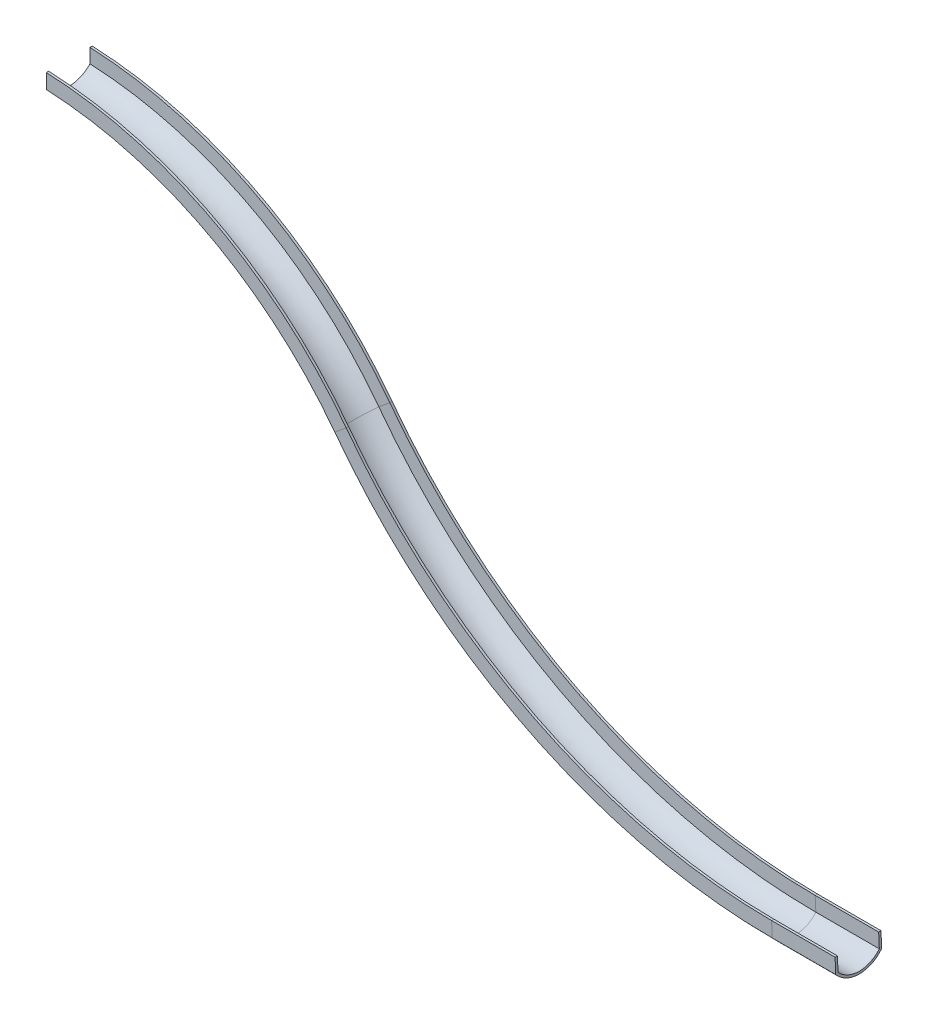
ISO-10303-21;
HEADER;
FILE_DESCRIPTION(('STEP AP214'),'2;1');
FILE_NAME('part.step','',(''),(''),'','','');
FILE_SCHEMA(('AUTOMOTIVE_DESIGN { 1 0 10303 214 1 1 1 1 }'));
ENDSEC;
DATA;
#1=APPLICATION_CONTEXT('core data for automotive mechanical design processes');
#2=APPLICATION_PROTOCOL_DEFINITION('international standard','automotive_design',2000,#1);
#3=PRODUCT_CONTEXT('',#1,'mechanical');
#4=PRODUCT('Part','Part','',(#3));
#5=PRODUCT_RELATED_PRODUCT_CATEGORY('part','',(#4));
#6=PRODUCT_DEFINITION_FORMATION('','',#4);
#7=PRODUCT_DEFINITION_CONTEXT('part definition',#1,'design');
#8=PRODUCT_DEFINITION('design','',#6,#7);
#9=PRODUCT_DEFINITION_SHAPE('','',#8);
#10=(LENGTH_UNIT() NAMED_UNIT(*) SI_UNIT(.MILLI.,.METRE.));
#11=(NAMED_UNIT(*) PLANE_ANGLE_UNIT() SI_UNIT($,.RADIAN.));
#12=(NAMED_UNIT(*) SI_UNIT($,.STERADIAN.) SOLID_ANGLE_UNIT());
#13=UNCERTAINTY_MEASURE_WITH_UNIT(LENGTH_MEASURE(1.E-05),#10,'distance_accuracy_value','');
#14=(GEOMETRIC_REPRESENTATION_CONTEXT(3) GLOBAL_UNCERTAINTY_ASSIGNED_CONTEXT((#13)) GLOBAL_UNIT_ASSIGNED_CONTEXT((#10,
#11,#12)) REPRESENTATION_CONTEXT('',''));
#15=CARTESIAN_POINT('',(0.,0.,0.));
#16=DIRECTION('',(0.,0.,1.));
#17=DIRECTION('',(1.,0.,0.));
#18=AXIS2_PLACEMENT_3D('',#15,#16,#17);
#19=CARTESIAN_POINT('',(0.,649.982066690495,-4.82835176366716));
#20=DIRECTION('',(1.,0.,0.));
#21=DIRECTION('',(0.,0.,-1.));
#22=AXIS2_PLACEMENT_3D('',#19,#20,#21);
#23=PLANE('',#22);
#24=CARTESIAN_POINT('',(0.,649.982066690495,-4.82835176366716));
#25=DIRECTION('',(-1.,0.,0.));
#26=DIRECTION('',(0.,0.,-1.));
#27=AXIS2_PLACEMENT_3D('',#24,#25,#26);
#28=CIRCLE('',#27,600.);
#29=CARTESIAN_POINT('',(0.,243.093628659328,-445.783903941613));
#30=VERTEX_POINT('',#29);
#31=CARTESIAN_POINT('',(0.,250.000205972115,442.401467340854));
#32=VERTEX_POINT('',#31);
#33=EDGE_CURVE('E223',#30,#32,#28,.T.);
#34=ORIENTED_EDGE('',*,*,#33,.F.);
#35=DIRECTION('',(0.,-1.,0.));
#36=VECTOR('',#35,1.);
#37=CARTESIAN_POINT('',(0.,243.093628659327,-445.783903941613));
#38=LINE('',#37,#36);
#39=CARTESIAN_POINT('',(0.,550.000205972116,-445.783903941613));
#40=VERTEX_POINT('',#39);
#41=EDGE_CURVE('E143',#40,#30,#38,.T.);
#42=ORIENTED_EDGE('',*,*,#41,.F.);
#43=DIRECTION('',(0.,0.,1.));
#44=VECTOR('',#43,1.);
#45=CARTESIAN_POINT('',(0.,550.000205972115,-445.783903941613));
#46=LINE('',#45,#44);
#47=CARTESIAN_POINT('',(0.,550.000205972116,-495.783903941613));
#48=VERTEX_POINT('',#47);
#49=EDGE_CURVE('E147',#48,#40,#46,.T.);
#50=ORIENTED_EDGE('',*,*,#49,.F.);
#51=DIRECTION('',(0.,1.,0.));
#52=VECTOR('',#51,1.);
#53=CARTESIAN_POINT('',(0.,223.99774093936,-495.783903941613));
#54=LINE('',#53,#52);
#55=CARTESIAN_POINT('',(0.,223.997740939361,-495.783903941613));
#56=VERTEX_POINT('',#55);
#57=EDGE_CURVE('E152',#56,#48,#54,.T.);
#58=ORIENTED_EDGE('',*,*,#57,.F.);
#59=CARTESIAN_POINT('',(0.,649.982066690495,-4.82835176366716));
#60=DIRECTION('',(1.,0.,0.));
#61=DIRECTION('',(0.,0.,-1.));
#62=AXIS2_PLACEMENT_3D('',#59,#60,#61);
#63=CIRCLE('',#62,650.);
#64=CARTESIAN_POINT('',(0.,231.338415128351,492.401467340854));
#65=VERTEX_POINT('',#64);
#66=EDGE_CURVE('E261',#65,#56,#63,.T.);
#67=ORIENTED_EDGE('',*,*,#66,.F.);
#68=DIRECTION('',(0.,-1.,0.));
#69=VECTOR('',#68,1.);
#70=CARTESIAN_POINT('',(0.,231.338415128351,492.401467340854));
#71=LINE('',#70,#69);
#72=CARTESIAN_POINT('',(0.,550.000205972116,492.401467340854));
#73=VERTEX_POINT('',#72);
#74=EDGE_CURVE('E207',#73,#65,#71,.T.);
#75=ORIENTED_EDGE('',*,*,#74,.F.);
#76=DIRECTION('',(0.,0.,1.));
#77=VECTOR('',#76,1.);
#78=CARTESIAN_POINT('',(0.,550.000205972115,492.401467340854));
#79=LINE('',#78,#77);
#80=CARTESIAN_POINT('',(0.,550.000205972116,442.401467340854));
#81=VERTEX_POINT('',#80);
#82=EDGE_CURVE('E202',#81,#73,#79,.T.);
#83=ORIENTED_EDGE('',*,*,#82,.F.);
#84=DIRECTION('',(0.,1.,0.));
#85=VECTOR('',#84,1.);
#86=CARTESIAN_POINT('',(0.,250.000205972115,442.401467340854));
#87=LINE('',#86,#85);
#88=EDGE_CURVE('E204',#32,#81,#87,.T.);
#89=ORIENTED_EDGE('',*,*,#88,.F.);
#90=EDGE_LOOP('',(#34,#42,#50,#58,#67,#75,#83,#89));
#91=FACE_BOUND('',#90,.T.);
#92=ADVANCED_FACE('F39',(#91),#23,.F.);
#93=CARTESIAN_POINT('',(16969.7298408799,-7350.72316806612,-4.82835176366716));
#94=DIRECTION('',(0.998914993516345,0.0465707604430124,0.));
#95=DIRECTION('',(0.,0.,-1.));
#96=AXIS2_PLACEMENT_3D('',#93,#94,#95);
#97=PLANE('',#96);
#98=CARTESIAN_POINT('',(16969.7298408799,-7350.72316806612,-4.82835176366716));
#99=DIRECTION('',(-0.998914993516345,-0.0465707604430124,0.));
#100=DIRECTION('',(0.,0.,-1.));
#101=AXIS2_PLACEMENT_3D('',#98,#99,#100);
#102=CIRCLE('',#101,600.);
#103=CARTESIAN_POINT('',(16988.6789448545,-7757.1701295039,-445.783903941613));
#104=VERTEX_POINT('',#103);
#105=CARTESIAN_POINT('',(16988.357300297,-7750.27104587228,442.401467340854));
#106=VERTEX_POINT('',#105);
#107=EDGE_CURVE('E53',#104,#106,#102,.T.);
#108=ORIENTED_EDGE('',*,*,#107,.T.);
#109=DIRECTION('',(-0.0465707604430124,0.998914993516345,0.));
#110=VECTOR('',#109,1.);
#111=CARTESIAN_POINT('',(16988.357300297,-7750.27104587228,442.401467340854));
#112=LINE('',#111,#110);
#113=CARTESIAN_POINT('',(16974.3860721641,-7450.59654781737,442.401467340854));
#114=VERTEX_POINT('',#113);
#115=EDGE_CURVE('E11',#106,#114,#112,.T.);
#116=ORIENTED_EDGE('',*,*,#115,.T.);
#117=DIRECTION('',(0.,0.,1.));
#118=VECTOR('',#117,1.);
#119=CARTESIAN_POINT('',(16974.3860721641,-7450.59654781737,492.401467340854));
#120=LINE('',#119,#118);
#121=CARTESIAN_POINT('',(16974.3860721641,-7450.59654781737,492.401467340854));
#122=VERTEX_POINT('',#121);
#123=EDGE_CURVE('E172',#114,#122,#120,.T.);
#124=ORIENTED_EDGE('',*,*,#123,.T.);
#125=DIRECTION('',(0.0465707604430124,-0.998914993516345,0.));
#126=VECTOR('',#125,1.);
#127=CARTESIAN_POINT('',(16989.2263940878,-7768.91258855198,492.401467340854));
#128=LINE('',#127,#126);
#129=CARTESIAN_POINT('',(16989.2263940878,-7768.91258855198,492.401467340854));
#130=VERTEX_POINT('',#129);
#131=EDGE_CURVE('E169',#122,#130,#128,.T.);
#132=ORIENTED_EDGE('',*,*,#131,.T.);
#133=CARTESIAN_POINT('',(16969.7298408799,-7350.72316806612,-4.82835176366716));
#134=DIRECTION('',(0.998914993516345,0.0465707604430124,0.));
#135=DIRECTION('',(0.,0.,-1.));
#136=AXIS2_PLACEMENT_3D('',#133,#134,#135);
#137=CIRCLE('',#136,650.);
#138=CARTESIAN_POINT('',(16989.5682548669,-7776.24529806188,-495.783903941613));
#139=VERTEX_POINT('',#138);
#140=EDGE_CURVE('E165',#130,#139,#137,.T.);
#141=ORIENTED_EDGE('',*,*,#140,.T.);
#142=DIRECTION('',(-0.0465707604430124,0.998914993516345,0.));
#143=VECTOR('',#142,1.);
#144=CARTESIAN_POINT('',(16989.5682548669,-7776.24529806188,-495.783903941613));
#145=LINE('',#144,#143);
#146=CARTESIAN_POINT('',(16974.3860721641,-7450.59654781737,-495.783903941613));
#147=VERTEX_POINT('',#146);
#148=EDGE_CURVE('E305',#139,#147,#145,.T.);
#149=ORIENTED_EDGE('',*,*,#148,.T.);
#150=DIRECTION('',(0.,0.,1.));
#151=VECTOR('',#150,1.);
#152=CARTESIAN_POINT('',(16974.3860721641,-7450.59654781737,-445.783903941613));
#153=LINE('',#152,#151);
#154=CARTESIAN_POINT('',(16974.3860721641,-7450.59654781737,-445.783903941613));
#155=VERTEX_POINT('',#154);
#156=EDGE_CURVE('E328',#147,#155,#153,.T.);
#157=ORIENTED_EDGE('',*,*,#156,.T.);
#158=DIRECTION('',(0.0465707604430124,-0.998914993516345,0.));
#159=VECTOR('',#158,1.);
#160=CARTESIAN_POINT('',(16988.6789448545,-7757.1701295039,-445.783903941613));
#161=LINE('',#160,#159);
#162=EDGE_CURVE('E59',#155,#104,#161,.T.);
#163=ORIENTED_EDGE('',*,*,#162,.T.);
#164=EDGE_LOOP('',(#108,#116,#124,#132,#141,#149,#157,#163));
#165=FACE_BOUND('',#164,.T.);
#166=ADVANCED_FACE('F432',(#165),#97,.T.);
#167=CARTESIAN_POINT('',(-372.5660835441,-7991.31994813076,0.));
#168=DIRECTION('',(0.,0.,-1.));
#169=DIRECTION('',(-1.,0.,0.));
#170=AXIS2_PLACEMENT_3D('',#167,#168,#169);
#171=CYLINDRICAL_SURFACE('',#170,8549.44182163323);
#172=CARTESIAN_POINT('',(-372.5660835441,-7991.31994813076,492.401467340854));
#173=DIRECTION('',(0.,0.,-1.));
#174=DIRECTION('',(0.0435778254670814,0.99905003534736,0.));
#175=AXIS2_PLACEMENT_3D('',#172,#173,#174);
#176=CIRCLE('',#175,8549.44182163323);
#177=CARTESIAN_POINT('',(6454.38071349598,-2844.88886514951,492.401467340854));
#178=VERTEX_POINT('',#177);
#179=EDGE_CURVE('E232',#73,#178,#176,.T.);
#180=ORIENTED_EDGE('',*,*,#179,.T.);
#181=DIRECTION('',(0.,0.,1.));
#182=VECTOR('',#181,1.);
#183=CARTESIAN_POINT('',(6454.38071349598,-2844.88886514951,492.401467340854));
#184=LINE('',#183,#182);
#185=CARTESIAN_POINT('',(6454.38071349598,-2844.88886514951,442.401467340854));
#186=VERTEX_POINT('',#185);
#187=EDGE_CURVE('E228',#186,#178,#184,.T.);
#188=ORIENTED_EDGE('',*,*,#187,.F.);
#189=CARTESIAN_POINT('',(-372.5660835441,-7991.31994813076,442.401467340854));
#190=DIRECTION('',(0.,0.,-1.));
#191=DIRECTION('',(0.0435778254670814,0.99905003534736,0.));
#192=AXIS2_PLACEMENT_3D('',#189,#190,#191);
#193=CIRCLE('',#192,8549.44182163323);
#194=EDGE_CURVE('E219',#81,#186,#193,.T.);
#195=ORIENTED_EDGE('',*,*,#194,.F.);
#196=ORIENTED_EDGE('',*,*,#82,.T.);
#197=EDGE_LOOP('',(#180,#188,#195,#196));
#198=FACE_BOUND('',#197,.T.);
#199=ADVANCED_FACE('F226',(#198),#171,.T.);
#200=CARTESIAN_POINT('',(0.,231.338415128351,492.401467340854));
#201=DIRECTION('',(0.,0.,1.));
#202=DIRECTION('',(1.,0.,0.));
#203=AXIS2_PLACEMENT_3D('',#200,#201,#202);
#204=PLANE('',#203);
#205=CARTESIAN_POINT('',(-372.5660835441,-7991.31994813076,492.401467340854));
#206=DIRECTION('',(0.,0.,-1.));
#207=DIRECTION('',(0.0452632496511293,0.998975093899252,0.));
#208=AXIS2_PLACEMENT_3D('',#205,#206,#207);
#209=CIRCLE('',#208,8231.09446218924);
#210=CARTESIAN_POINT('',(6208.52207936231,-3047.61742496701,492.401467340854));
#211=VERTEX_POINT('',#210);
#212=EDGE_CURVE('E266',#65,#211,#209,.T.);
#213=ORIENTED_EDGE('',*,*,#212,.T.);
#214=DIRECTION('',(-0.771534715482141,-0.636187223076581,0.));
#215=VECTOR('',#214,1.);
#216=CARTESIAN_POINT('',(6208.52207936231,-3047.61742496701,492.401467340854));
#217=LINE('',#216,#215);
#218=EDGE_CURVE('E262',#178,#211,#217,.T.);
#219=ORIENTED_EDGE('',*,*,#218,.F.);
#220=ORIENTED_EDGE('',*,*,#179,.F.);
#221=ORIENTED_EDGE('',*,*,#74,.T.);
#222=EDGE_LOOP('',(#213,#219,#220,#221));
#223=FACE_BOUND('',#222,.T.);
#224=ADVANCED_FACE('F422',(#223),#204,.T.);
#225=CARTESIAN_POINT('',(0.,231.338415128351,492.401467340854));
#226=CARTESIAN_POINT('',(2497.00281606505,118.199997030288,492.401467340854));
#227=CARTESIAN_POINT('',(4707.25100901287,-1049.11585168308,492.401467340854));
#228=CARTESIAN_POINT('',(6208.52207936231,-3047.61742496701,492.401467340854));
#229=CARTESIAN_POINT('',(0.,-97.4130444083914,215.608511269337));
#230=CARTESIAN_POINT('',(2397.16973484199,-210.551462506454,215.608511269337));
#231=CARTESIAN_POINT('',(4517.12037592933,-1335.28801772527,215.608511269337));
#232=CARTESIAN_POINT('',(5954.87891556429,-3256.76490309207,215.608511269337));
#233=CARTESIAN_POINT('',(0.,-100.605386517561,-214.137543546999));
#234=CARTESIAN_POINT('',(2396.20030538447,-213.743804615624,-214.137543546999));
#235=CARTESIAN_POINT('',(4515.27411180296,-1338.0668934675,-214.137543546999));
#236=CARTESIAN_POINT('',(5952.41591280337,-3258.79583035361,-214.137543546999));
#237=CARTESIAN_POINT('',(0.,223.997740939361,-495.783903941613));
#238=CARTESIAN_POINT('',(2494.77364840272,110.859322841298,-495.783903941613));
#239=CARTESIAN_POINT('',(4703.00559202589,-1055.505775049,-495.783903941613));
#240=CARTESIAN_POINT('',(6202.85849439046,-3052.28746809482,-495.783903941613));
#241=(BOUNDED_SURFACE() B_SPLINE_SURFACE(3,3,((#225,#226,#227,#228),(#229,#230,#231,#232),(#233,
#234,#235,#236),(#237,#238,#239,#240)),.UNSPECIFIED.,.F.,.F.,
.F.) B_SPLINE_SURFACE_WITH_KNOTS((4,4),(4,4),(0.,1.),(0.,1.),
.UNSPECIFIED.) GEOMETRIC_REPRESENTATION_ITEM() RATIONAL_B_SPLINE_SURFACE(((1.,0.93632351624155,
0.93632351624155,1.),(0.766487836407477,0.717680586141426,0.717680586141426,0.766487836407477),
(0.766487836407477,0.717680586141426,0.717680586141426,0.766487836407477),(1.,0.93632351624155,
0.93632351624155,1.))) REPRESENTATION_ITEM('') SURFACE());
#242=CARTESIAN_POINT('',(-372.5660835441,-7991.31994813076,-495.783903941613));
#243=DIRECTION('',(0.,0.,-1.));
#244=DIRECTION('',(0.0453036109789485,0.998973264323059,0.));
#245=AXIS2_PLACEMENT_3D('',#242,#243,#244);
#246=CIRCLE('',#245,8223.76131821418);
#247=CARTESIAN_POINT('',(6202.85849439046,-3052.28746809482,-495.783903941613));
#248=VERTEX_POINT('',#247);
#249=EDGE_CURVE('E287',#56,#248,#246,.T.);
#250=CARTESIAN_POINT('',(6531.52018995871,-2781.28168282105,-4.82835176366716));
#251=DIRECTION('',(0.636187223076581,-0.771534715482141,0.));
#252=DIRECTION('',(0.,0.,-1.));
#253=AXIS2_PLACEMENT_3D('',#250,#251,#252);
#254=CIRCLE('',#253,650.);
#255=EDGE_CURVE('E270',#211,#248,#254,.T.);
#256=ORIENTED_EDGE('',*,*,#249,.T.);
#257=ORIENTED_EDGE('',*,*,#255,.F.);
#258=ORIENTED_EDGE('',*,*,#212,.F.);
#259=ORIENTED_EDGE('',*,*,#66,.T.);
#260=EDGE_LOOP('',(#256,#257,#258,#259));
#261=FACE_BOUND('',#260,.T.);
#262=ADVANCED_FACE('F419',(#261),#241,.T.);
#263=CARTESIAN_POINT('',(0.,223.99774093936,-495.783903941613));
#264=DIRECTION('',(0.,0.,-1.));
#265=DIRECTION('',(-1.,0.,0.));
#266=AXIS2_PLACEMENT_3D('',#263,#264,#265);
#267=PLANE('',#266);
#268=CARTESIAN_POINT('',(-372.5660835441,-7991.31994813076,-495.783903941613));
#269=DIRECTION('',(0.,0.,-1.));
#270=DIRECTION('',(0.0435778254670814,0.99905003534736,0.));
#271=AXIS2_PLACEMENT_3D('',#268,#269,#270);
#272=CIRCLE('',#271,8549.44182163323);
#273=CARTESIAN_POINT('',(6454.38071349598,-2844.88886514951,-495.783903941613));
#274=VERTEX_POINT('',#273);
#275=EDGE_CURVE('E311',#48,#274,#272,.T.);
#276=ORIENTED_EDGE('',*,*,#275,.T.);
#277=DIRECTION('',(0.771534715482141,0.636187223076581,0.));
#278=VECTOR('',#277,1.);
#279=CARTESIAN_POINT('',(6202.85849439046,-3052.28746809482,-495.783903941613));
#280=LINE('',#279,#278);
#281=EDGE_CURVE('E291',#248,#274,#280,.T.);
#282=ORIENTED_EDGE('',*,*,#281,.F.);
#283=ORIENTED_EDGE('',*,*,#249,.F.);
#284=ORIENTED_EDGE('',*,*,#57,.T.);
#285=EDGE_LOOP('',(#276,#282,#283,#284));
#286=FACE_BOUND('',#285,.T.);
#287=ADVANCED_FACE('F430',(#286),#267,.T.);
#288=CARTESIAN_POINT('',(-372.5660835441,-7991.31994813076,0.));
#289=DIRECTION('',(0.,0.,-1.));
#290=DIRECTION('',(-1.,0.,0.));
#291=AXIS2_PLACEMENT_3D('',#288,#289,#290);
#292=CYLINDRICAL_SURFACE('',#291,8549.44182163323);
#293=CARTESIAN_POINT('',(-372.5660835441,-7991.31994813076,-445.783903941613));
#294=DIRECTION('',(0.,0.,-1.));
#295=DIRECTION('',(0.0435778254670814,0.99905003534736,0.));
#296=AXIS2_PLACEMENT_3D('',#293,#294,#295);
#297=CIRCLE('',#296,8549.44182163323);
#298=CARTESIAN_POINT('',(6454.38071349598,-2844.88886514951,-445.783903941613));
#299=VERTEX_POINT('',#298);
#300=EDGE_CURVE('E333',#40,#299,#297,.T.);
#301=ORIENTED_EDGE('',*,*,#300,.T.);
#302=DIRECTION('',(0.,0.,1.));
#303=VECTOR('',#302,1.);
#304=CARTESIAN_POINT('',(6454.38071349598,-2844.88886514951,-445.783903941613));
#305=LINE('',#304,#303);
#306=EDGE_CURVE('E315',#274,#299,#305,.T.);
#307=ORIENTED_EDGE('',*,*,#306,.F.);
#308=ORIENTED_EDGE('',*,*,#275,.F.);
#309=ORIENTED_EDGE('',*,*,#49,.T.);
#310=EDGE_LOOP('',(#301,#307,#308,#309));
#311=FACE_BOUND('',#310,.T.);
#312=ADVANCED_FACE('F479',(#311),#292,.T.);
#313=CARTESIAN_POINT('',(0.,243.093628659327,-445.783903941613));
#314=DIRECTION('',(0.,0.,1.));
#315=DIRECTION('',(1.,0.,0.));
#316=AXIS2_PLACEMENT_3D('',#313,#314,#315);
#317=PLANE('',#316);
#318=CARTESIAN_POINT('',(-372.5660835441,-7991.31994813076,-445.783903941613));
#319=DIRECTION('',(0.,0.,-1.));
#320=DIRECTION('',(0.0451987652303781,0.998978013582706,0.));
#321=AXIS2_PLACEMENT_3D('',#318,#319,#320);
#322=CIRCLE('',#321,8242.83764490314);
#323=CARTESIAN_POINT('',(6217.59163468936,-3040.13890831407,-445.783903941613));
#324=VERTEX_POINT('',#323);
#325=EDGE_CURVE('E352',#30,#324,#322,.T.);
#326=ORIENTED_EDGE('',*,*,#325,.T.);
#327=DIRECTION('',(-0.771534715482141,-0.636187223076581,0.));
#328=VECTOR('',#327,1.);
#329=CARTESIAN_POINT('',(6217.59163468936,-3040.13890831407,-445.783903941613));
#330=LINE('',#329,#328);
#331=EDGE_CURVE('E337',#299,#324,#330,.T.);
#332=ORIENTED_EDGE('',*,*,#331,.F.);
#333=ORIENTED_EDGE('',*,*,#300,.F.);
#334=ORIENTED_EDGE('',*,*,#41,.T.);
#335=EDGE_LOOP('',(#326,#332,#333,#334));
#336=FACE_BOUND('',#335,.T.);
#337=ADVANCED_FACE('F489',(#336),#317,.T.);
#338=CARTESIAN_POINT('',(0.,243.093628659327,-445.783903941613));
#339=CARTESIAN_POINT('',(2500.57256200286,129.955210561265,-445.783903941613));
#340=CARTESIAN_POINT('',(4714.04953758465,-1038.88315211366,-445.783903941613));
#341=CARTESIAN_POINT('',(6217.59163468936,-3040.13890831407,-445.783903941613));
#342=CARTESIAN_POINT('',(0.,-35.2940243676663,-188.9037790677));
#343=CARTESIAN_POINT('',(2416.03363032693,-148.432442465729,-188.9037790677));
#344=CARTESIAN_POINT('',(4553.04638709751,-1281.21454062947,-188.9037790677));
#345=CARTESIAN_POINT('',(6002.80589601744,-3217.24557623212,-188.9037790677));
#346=CARTESIAN_POINT('',(0.,-32.3485683867844,189.881659145254));
#347=CARTESIAN_POINT('',(2416.92808702863,-145.486986484847,189.881659145254));
#348=CARTESIAN_POINT('',(4554.74986671446,-1278.65057477143,189.881659145254));
#349=CARTESIAN_POINT('',(6005.07841755961,-3215.37171477095,189.881659145254));
#350=CARTESIAN_POINT('',(0.,250.000205972115,442.401467340854));
#351=CARTESIAN_POINT('',(2502.66990598063,136.861787874052,442.401467340854));
#352=CARTESIAN_POINT('',(4718.04389830558,-1032.87110218292,442.401467340854));
#353=CARTESIAN_POINT('',(6222.92029885134,-3035.74503207248,442.401467340854));
#354=(BOUNDED_SURFACE() B_SPLINE_SURFACE(3,3,((#338,#339,#340,#341),(#342,#343,#344,#345),(#346,
#347,#348,#349),(#350,#351,#352,#353)),.UNSPECIFIED.,.F.,.F.,
.F.) B_SPLINE_SURFACE_WITH_KNOTS((4,4),(4,4),(0.,1.),(0.,1.),
.UNSPECIFIED.) GEOMETRIC_REPRESENTATION_ITEM() RATIONAL_B_SPLINE_SURFACE(((1.,0.93632351624155,
0.93632351624155,1.),(0.781608162722038,0.731838103242996,0.731838103242996,0.781608162722038),
(0.781608162722038,0.731838103242996,0.731838103242996,0.781608162722038),(1.,0.93632351624155,
0.93632351624155,1.))) REPRESENTATION_ITEM('') SURFACE());
#355=CARTESIAN_POINT('',(-372.5660835441,-7991.31994813076,442.401467340854));
#356=DIRECTION('',(0.,0.,-1.));
#357=DIRECTION('',(0.0451609640259511,0.99897972318173,0.));
#358=AXIS2_PLACEMENT_3D('',#355,#356,#357);
#359=CIRCLE('',#358,8249.73716969393);
#360=CARTESIAN_POINT('',(6222.92029885134,-3035.74503207249,442.401467340854));
#361=VERTEX_POINT('',#360);
#362=EDGE_CURVE('E221',#32,#361,#359,.T.);
#363=CARTESIAN_POINT('',(6531.52018995871,-2781.28168282105,-4.82835176366716));
#364=DIRECTION('',(-0.636187223076581,0.771534715482141,0.));
#365=DIRECTION('',(0.,0.,-1.));
#366=AXIS2_PLACEMENT_3D('',#363,#364,#365);
#367=CIRCLE('',#366,600.);
#368=EDGE_CURVE('E356',#324,#361,#367,.T.);
#369=ORIENTED_EDGE('',*,*,#362,.T.);
#370=ORIENTED_EDGE('',*,*,#368,.F.);
#371=ORIENTED_EDGE('',*,*,#325,.F.);
#372=ORIENTED_EDGE('',*,*,#33,.T.);
#373=EDGE_LOOP('',(#369,#370,#371,#372));
#374=FACE_BOUND('',#373,.T.);
#375=ADVANCED_FACE('F393',(#374),#354,.T.);
#376=CARTESIAN_POINT('',(0.,250.000205972115,442.401467340854));
#377=DIRECTION('',(0.,0.,-1.));
#378=DIRECTION('',(-1.,0.,0.));
#379=AXIS2_PLACEMENT_3D('',#376,#377,#378);
#380=PLANE('',#379);
#381=DIRECTION('',(0.771534715482141,0.636187223076581,0.));
#382=VECTOR('',#381,1.);
#383=CARTESIAN_POINT('',(6222.92029885134,-3035.74503207248,442.401467340854));
#384=LINE('',#383,#382);
#385=EDGE_CURVE('E249',#361,#186,#384,.T.);
#386=ORIENTED_EDGE('',*,*,#385,.F.);
#387=ORIENTED_EDGE('',*,*,#362,.F.);
#388=ORIENTED_EDGE('',*,*,#88,.T.);
#389=ORIENTED_EDGE('',*,*,#194,.T.);
#390=EDGE_LOOP('',(#386,#387,#388,#389));
#391=FACE_BOUND('',#390,.T.);
#392=ADVANCED_FACE('F218',(#391),#380,.T.);
#393=CARTESIAN_POINT('',(15633.9402779816,4000.,0.));
#394=DIRECTION('',(0.,0.,1.));
#395=DIRECTION('',(1.,0.,0.));
#396=AXIS2_PLACEMENT_3D('',#393,#394,#395);
#397=CYLINDRICAL_SURFACE('',#396,11450.625195778);
#398=CARTESIAN_POINT('',(15633.9402779816,4000.,492.401467340854));
#399=DIRECTION('',(0.,0.,1.));
#400=DIRECTION('',(-0.801664486221258,-0.597774247966242,0.));
#401=AXIS2_PLACEMENT_3D('',#398,#399,#400);
#402=CIRCLE('',#401,11450.625195778);
#403=CARTESIAN_POINT('',(15608.3263501456,-7450.59654781737,492.401467340854));
#404=VERTEX_POINT('',#403);
#405=EDGE_CURVE('E240',#178,#404,#402,.T.);
#406=ORIENTED_EDGE('',*,*,#405,.T.);
#407=DIRECTION('',(0.,0.,1.));
#408=VECTOR('',#407,1.);
#409=CARTESIAN_POINT('',(15608.3263501456,-7450.59654781737,492.401467340854));
#410=LINE('',#409,#408);
#411=CARTESIAN_POINT('',(15608.3263501456,-7450.59654781737,442.401467340854));
#412=VERTEX_POINT('',#411);
#413=EDGE_CURVE('E236',#412,#404,#410,.T.);
#414=ORIENTED_EDGE('',*,*,#413,.F.);
#415=CARTESIAN_POINT('',(15633.9402779816,4000.,442.401467340854));
#416=DIRECTION('',(0.,0.,1.));
#417=DIRECTION('',(-0.801664486221258,-0.597774247966242,0.));
#418=AXIS2_PLACEMENT_3D('',#415,#416,#417);
#419=CIRCLE('',#418,11450.625195778);
#420=EDGE_CURVE('E241',#186,#412,#419,.T.);
#421=ORIENTED_EDGE('',*,*,#420,.F.);
#422=ORIENTED_EDGE('',*,*,#187,.T.);
#423=EDGE_LOOP('',(#406,#414,#421,#422));
#424=FACE_BOUND('',#423,.T.);
#425=ADVANCED_FACE('F389',(#424),#397,.F.);
#426=CARTESIAN_POINT('',(6208.52207936231,-3047.61742496701,492.401467340854));
#427=DIRECTION('',(0.,0.,1.));
#428=DIRECTION('',(1.,0.,0.));
#429=AXIS2_PLACEMENT_3D('',#426,#427,#428);
#430=PLANE('',#429);
#431=CARTESIAN_POINT('',(15633.9402779816,4000.,492.401467340854));
#432=DIRECTION('',(0.,0.,1.));
#433=DIRECTION('',(-0.800873842710848,-0.598833105348694,0.));
#434=AXIS2_PLACEMENT_3D('',#431,#432,#433);
#435=CIRCLE('',#434,11768.9175197875);
#436=CARTESIAN_POINT('',(15623.1666720693,-7768.91258855198,492.401467340854));
#437=VERTEX_POINT('',#436);
#438=EDGE_CURVE('E273',#211,#437,#435,.T.);
#439=ORIENTED_EDGE('',*,*,#438,.T.);
#440=DIRECTION('',(0.0465707604430122,-0.998914993516345,0.));
#441=VECTOR('',#440,1.);
#442=CARTESIAN_POINT('',(15623.1666720693,-7768.91258855198,492.401467340854));
#443=LINE('',#442,#441);
#444=EDGE_CURVE('E245',#404,#437,#443,.T.);
#445=ORIENTED_EDGE('',*,*,#444,.F.);
#446=ORIENTED_EDGE('',*,*,#405,.F.);
#447=ORIENTED_EDGE('',*,*,#218,.T.);
#448=EDGE_LOOP('',(#439,#445,#446,#447));
#449=FACE_BOUND('',#448,.T.);
#450=ADVANCED_FACE('F415',(#449),#430,.T.);
#451=CARTESIAN_POINT('',(6208.52207936231,-3047.61742496701,492.401467340854));
#452=CARTESIAN_POINT('',(8470.22073313468,-6072.39223404492,492.401467340854));
#453=CARTESIAN_POINT('',(11846.3252017029,-7765.45515769008,492.401467340854));
#454=CARTESIAN_POINT('',(15623.1666720693,-7768.91258855197,492.401467340854));
#455=CARTESIAN_POINT('',(5954.87891556429,-3256.76490309206,215.608511269337));
#456=CARTESIAN_POINT('',(8283.69650346602,-6362.9380582363,215.608511269337));
#457=CARTESIAN_POINT('',(11756.2480192777,-8098.76322152124,215.608511269337));
#458=CARTESIAN_POINT('',(15638.4768775367,-8097.30735062361,215.608511269337));
#459=CARTESIAN_POINT('',(5952.41591280337,-3258.79583035361,-214.137543546999));
#460=CARTESIAN_POINT('',(8281.88525933165,-6365.75940440011,-214.137543546999));
#461=CARTESIAN_POINT('',(11755.373324507,-8101.99981055111,-214.137543546999));
#462=CARTESIAN_POINT('',(15638.6255473363,-8100.49622902089,-214.137543546999));
#463=CARTESIAN_POINT('',(6202.85849439046,-3052.28746809482,-495.783903941613));
#464=CARTESIAN_POINT('',(8466.0558433414,-6078.87981659548,-495.783903941613));
#465=CARTESIAN_POINT('',(11844.3138729958,-7772.89757605864,-495.783903941613));
#466=CARTESIAN_POINT('',(15623.5085328485,-7776.24529806188,-495.783903941613));
#467=(BOUNDED_SURFACE() B_SPLINE_SURFACE(3,3,((#451,#452,#453,#454),(#455,#456,#457,#458),(#459,
#460,#461,#462),(#463,#464,#465,#466)),.UNSPECIFIED.,.F.,.F.,
.F.) B_SPLINE_SURFACE_WITH_KNOTS((4,4),(4,4),(0.,1.),(0.,1.),
.UNSPECIFIED.) GEOMETRIC_REPRESENTATION_ITEM() RATIONAL_B_SPLINE_SURFACE(((1.,0.929537250239945,
0.929537250239945,1.),(0.766487836407477,0.712478995796571,0.712478995796571,0.766487836407477),
(0.766487836407477,0.712478995796571,0.712478995796571,0.766487836407477),(1.,0.929537250239945,
0.929537250239945,1.))) REPRESENTATION_ITEM('') SURFACE());
#468=CARTESIAN_POINT('',(15633.9402779816,4000.,-495.783903941613));
#469=DIRECTION('',(0.,0.,1.));
#470=DIRECTION('',(-0.800856117092728,-0.598856810694475,0.));
#471=AXIS2_PLACEMENT_3D('',#468,#469,#470);
#472=CIRCLE('',#471,11776.2499184346);
#473=CARTESIAN_POINT('',(15623.5085328485,-7776.24529806188,-495.783903941613));
#474=VERTEX_POINT('',#473);
#475=EDGE_CURVE('E294',#248,#474,#472,.T.);
#476=CARTESIAN_POINT('',(15603.6701188615,-7350.72316806612,-4.82835176366716));
#477=DIRECTION('',(0.998914993516345,0.0465707604430122,0.));
#478=DIRECTION('',(0.,0.,-1.));
#479=AXIS2_PLACEMENT_3D('',#476,#477,#478);
#480=CIRCLE('',#479,650.);
#481=EDGE_CURVE('E277',#437,#474,#480,.T.);
#482=ORIENTED_EDGE('',*,*,#475,.T.);
#483=ORIENTED_EDGE('',*,*,#481,.F.);
#484=ORIENTED_EDGE('',*,*,#438,.F.);
#485=ORIENTED_EDGE('',*,*,#255,.T.);
#486=EDGE_LOOP('',(#482,#483,#484,#485));
#487=FACE_BOUND('',#486,.T.);
#488=ADVANCED_FACE('F410',(#487),#467,.T.);
#489=CARTESIAN_POINT('',(6202.85849439046,-3052.28746809482,-495.783903941613));
#490=DIRECTION('',(0.,0.,-1.));
#491=DIRECTION('',(-1.,0.,0.));
#492=AXIS2_PLACEMENT_3D('',#489,#490,#491);
#493=PLANE('',#492);
#494=CARTESIAN_POINT('',(15633.9402779816,4000.,-495.783903941613));
#495=DIRECTION('',(0.,0.,1.));
#496=DIRECTION('',(-0.801664486221258,-0.597774247966242,0.));
#497=AXIS2_PLACEMENT_3D('',#494,#495,#496);
#498=CIRCLE('',#497,11450.625195778);
#499=CARTESIAN_POINT('',(15608.3263501456,-7450.59654781737,-495.783903941613));
#500=VERTEX_POINT('',#499);
#501=EDGE_CURVE('E128',#274,#500,#498,.T.);
#502=ORIENTED_EDGE('',*,*,#501,.T.);
#503=DIRECTION('',(-0.0465707604430122,0.998914993516345,0.));
#504=VECTOR('',#503,1.);
#505=CARTESIAN_POINT('',(15623.5085328485,-7776.24529806188,-495.783903941613));
#506=LINE('',#505,#504);
#507=EDGE_CURVE('E298',#474,#500,#506,.T.);
#508=ORIENTED_EDGE('',*,*,#507,.F.);
#509=ORIENTED_EDGE('',*,*,#475,.F.);
#510=ORIENTED_EDGE('',*,*,#281,.T.);
#511=EDGE_LOOP('',(#502,#508,#509,#510));
#512=FACE_BOUND('',#511,.T.);
#513=ADVANCED_FACE('F407',(#512),#493,.T.);
#514=CARTESIAN_POINT('',(15633.9402779816,4000.,0.));
#515=DIRECTION('',(0.,0.,1.));
#516=DIRECTION('',(1.,0.,0.));
#517=AXIS2_PLACEMENT_3D('',#514,#515,#516);
#518=CYLINDRICAL_SURFACE('',#517,11450.625195778);
#519=CARTESIAN_POINT('',(15633.9402779816,4000.,-445.783903941613));
#520=DIRECTION('',(0.,0.,1.));
#521=DIRECTION('',(-0.801664486221258,-0.597774247966242,0.));
#522=AXIS2_PLACEMENT_3D('',#519,#520,#521);
#523=CIRCLE('',#522,11450.625195778);
#524=CARTESIAN_POINT('',(15608.3263501456,-7450.59654781737,-445.783903941613));
#525=VERTEX_POINT('',#524);
#526=EDGE_CURVE('E119',#299,#525,#523,.T.);
#527=ORIENTED_EDGE('',*,*,#526,.T.);
#528=DIRECTION('',(0.,0.,1.));
#529=VECTOR('',#528,1.);
#530=CARTESIAN_POINT('',(15608.3263501456,-7450.59654781737,-445.783903941613));
#531=LINE('',#530,#529);
#532=EDGE_CURVE('E321',#500,#525,#531,.T.);
#533=ORIENTED_EDGE('',*,*,#532,.F.);
#534=ORIENTED_EDGE('',*,*,#501,.F.);
#535=ORIENTED_EDGE('',*,*,#306,.T.);
#536=EDGE_LOOP('',(#527,#533,#534,#535));
#537=FACE_BOUND('',#536,.T.);
#538=ADVANCED_FACE('F399',(#537),#518,.F.);
#539=CARTESIAN_POINT('',(6217.59163468936,-3040.13890831407,-445.783903941613));
#540=DIRECTION('',(0.,0.,1.));
#541=DIRECTION('',(1.,0.,0.));
#542=AXIS2_PLACEMENT_3D('',#539,#540,#541);
#543=PLANE('',#542);
#544=CARTESIAN_POINT('',(15633.9402779816,4000.,-445.783903941613));
#545=DIRECTION('',(0.,0.,1.));
#546=DIRECTION('',(-0.800902272758535,-0.598795081384453,0.));
#547=AXIS2_PLACEMENT_3D('',#544,#545,#546);
#548=CIRCLE('',#547,11757.1755800612);
#549=CARTESIAN_POINT('',(15622.619222836,-7757.1701295039,-445.783903941613));
#550=VERTEX_POINT('',#549);
#551=EDGE_CURVE('E112',#324,#550,#548,.T.);
#552=ORIENTED_EDGE('',*,*,#551,.T.);
#553=DIRECTION('',(0.0465707604430122,-0.998914993516345,0.));
#554=VECTOR('',#553,1.);
#555=CARTESIAN_POINT('',(15622.619222836,-7757.1701295039,-445.783903941613));
#556=LINE('',#555,#554);
#557=EDGE_CURVE('E343',#525,#550,#556,.T.);
#558=ORIENTED_EDGE('',*,*,#557,.F.);
#559=ORIENTED_EDGE('',*,*,#526,.F.);
#560=ORIENTED_EDGE('',*,*,#331,.T.);
#561=EDGE_LOOP('',(#552,#558,#559,#560));
#562=FACE_BOUND('',#561,.T.);
#563=ADVANCED_FACE('F398',(#562),#543,.T.);
#564=CARTESIAN_POINT('',(6217.59163468936,-3040.13890831407,-445.783903941613));
#565=CARTESIAN_POINT('',(8476.89030701747,-6062.0031449479,-445.783903941613));
#566=CARTESIAN_POINT('',(11849.546104555,-7753.5370129997,-445.783903941613));
#567=CARTESIAN_POINT('',(15622.619222836,-7757.1701295039,-445.783903941613));
#568=CARTESIAN_POINT('',(6002.80589601744,-3217.24557623212,-188.9037790677));
#569=CARTESIAN_POINT('',(8318.94106900254,-6308.03815938528,-188.9037790677));
#570=CARTESIAN_POINT('',(11773.2684951964,-8035.78321125439,-188.9037790677));
#571=CARTESIAN_POINT('',(15635.5839475354,-8035.25573012239,-188.9037790677));
#572=CARTESIAN_POINT('',(6005.07841755961,-3215.37171477095,189.881659145254));
#573=CARTESIAN_POINT('',(8320.61223696825,-6305.43500764022,189.881659145254));
#574=CARTESIAN_POINT('',(11774.0755437068,-8032.79693027645,189.881659145254));
#575=CARTESIAN_POINT('',(15635.4467754106,-8032.31346998034,189.881659145254));
#576=CARTESIAN_POINT('',(6222.92029885134,-3035.74503207248,442.401467340854));
#577=CARTESIAN_POINT('',(8480.8089025873,-6055.89921098967,442.401467340854));
#578=CARTESIAN_POINT('',(11851.4384916654,-7746.53470823406,442.401467340854));
#579=CARTESIAN_POINT('',(15622.2975782785,-7750.27104587227,442.401467340854));
#580=(BOUNDED_SURFACE() B_SPLINE_SURFACE(3,3,((#564,#565,#566,#567),(#568,#569,#570,#571),(#572,
#573,#574,#575),(#576,#577,#578,#579)),.UNSPECIFIED.,.F.,.F.,
.F.) B_SPLINE_SURFACE_WITH_KNOTS((4,4),(4,4),(0.,1.),(0.,1.),
.UNSPECIFIED.) GEOMETRIC_REPRESENTATION_ITEM() RATIONAL_B_SPLINE_SURFACE(((1.,0.929537250239945,
0.929537250239945,1.),(0.781608162722038,0.726533902341739,0.726533902341739,0.781608162722038),
(0.781608162722038,0.726533902341739,0.726533902341739,0.781608162722038),(1.,0.929537250239945,
0.929537250239945,1.))) REPRESENTATION_ITEM('') SURFACE());
#581=CARTESIAN_POINT('',(15633.9402779816,4000.,442.401467340854));
#582=DIRECTION('',(0.,0.,1.));
#583=DIRECTION('',(-0.800919002008146,-0.59877270497433,0.));
#584=AXIS2_PLACEMENT_3D('',#581,#582,#583);
#585=CIRCLE('',#584,11750.2768139274);
#586=CARTESIAN_POINT('',(15622.2975782785,-7750.27104587228,442.401467340854));
#587=VERTEX_POINT('',#586);
#588=EDGE_CURVE('E374',#361,#587,#585,.T.);
#589=CARTESIAN_POINT('',(15603.6701188615,-7350.72316806612,-4.82835176366716));
#590=DIRECTION('',(-0.998914993516345,-0.0465707604430122,0.));
#591=DIRECTION('',(0.,0.,-1.));
#592=AXIS2_PLACEMENT_3D('',#589,#590,#591);
#593=CIRCLE('',#592,600.);
#594=EDGE_CURVE('E361',#550,#587,#593,.T.);
#595=ORIENTED_EDGE('',*,*,#588,.T.);
#596=ORIENTED_EDGE('',*,*,#594,.F.);
#597=ORIENTED_EDGE('',*,*,#551,.F.);
#598=ORIENTED_EDGE('',*,*,#368,.T.);
#599=EDGE_LOOP('',(#595,#596,#597,#598));
#600=FACE_BOUND('',#599,.T.);
#601=ADVANCED_FACE('F395',(#600),#580,.T.);
#602=CARTESIAN_POINT('',(6222.92029885134,-3035.74503207248,442.401467340854));
#603=DIRECTION('',(0.,0.,-1.));
#604=DIRECTION('',(-1.,0.,0.));
#605=AXIS2_PLACEMENT_3D('',#602,#603,#604);
#606=PLANE('',#605);
#607=DIRECTION('',(-0.0465707604430122,0.998914993516345,0.));
#608=VECTOR('',#607,1.);
#609=CARTESIAN_POINT('',(15622.2975782785,-7750.27104587227,442.401467340854));
#610=LINE('',#609,#608);
#611=EDGE_CURVE('E258',#587,#412,#610,.T.);
#612=ORIENTED_EDGE('',*,*,#611,.F.);
#613=ORIENTED_EDGE('',*,*,#588,.F.);
#614=ORIENTED_EDGE('',*,*,#385,.T.);
#615=ORIENTED_EDGE('',*,*,#420,.T.);
#616=EDGE_LOOP('',(#612,#613,#614,#615));
#617=FACE_BOUND('',#616,.T.);
#618=ADVANCED_FACE('F391',(#617),#606,.T.);
#619=CARTESIAN_POINT('',(15608.3263501456,-7450.59654781737,492.401467340854));
#620=DIRECTION('',(0.,1.,0.));
#621=DIRECTION('',(0.,0.,1.));
#622=AXIS2_PLACEMENT_3D('',#619,#620,#621);
#623=PLANE('',#622);
#624=DIRECTION('',(1.,0.,0.));
#625=VECTOR('',#624,1.);
#626=CARTESIAN_POINT('',(15608.3263501456,-7450.59654781737,492.401467340854));
#627=LINE('',#626,#625);
#628=EDGE_CURVE('E188',#404,#122,#627,.T.);
#629=ORIENTED_EDGE('',*,*,#628,.T.);
#630=ORIENTED_EDGE('',*,*,#123,.F.);
#631=DIRECTION('',(1.,0.,0.));
#632=VECTOR('',#631,1.);
#633=CARTESIAN_POINT('',(15608.3263501456,-7450.59654781737,442.401467340854));
#634=LINE('',#633,#632);
#635=EDGE_CURVE('E252',#412,#114,#634,.T.);
#636=ORIENTED_EDGE('',*,*,#635,.F.);
#637=ORIENTED_EDGE('',*,*,#413,.T.);
#638=EDGE_LOOP('',(#629,#630,#636,#637));
#639=FACE_BOUND('',#638,.T.);
#640=ADVANCED_FACE('F578',(#639),#623,.T.);
#641=CARTESIAN_POINT('',(15623.1666720693,-7768.91258855198,492.401467340854));
#642=DIRECTION('',(0.,0.,1.));
#643=DIRECTION('',(1.,0.,0.));
#644=AXIS2_PLACEMENT_3D('',#641,#642,#643);
#645=PLANE('',#644);
#646=DIRECTION('',(1.,0.,0.));
#647=VECTOR('',#646,1.);
#648=CARTESIAN_POINT('',(15623.1666720693,-7768.91258855198,492.401467340854));
#649=LINE('',#648,#647);
#650=EDGE_CURVE('E182',#437,#130,#649,.T.);
#651=ORIENTED_EDGE('',*,*,#650,.T.);
#652=ORIENTED_EDGE('',*,*,#131,.F.);
#653=ORIENTED_EDGE('',*,*,#628,.F.);
#654=ORIENTED_EDGE('',*,*,#444,.T.);
#655=EDGE_LOOP('',(#651,#652,#653,#654));
#656=FACE_BOUND('',#655,.T.);
#657=ADVANCED_FACE('F413',(#656),#645,.T.);
#658=CARTESIAN_POINT('',(15623.1666720693,-7768.91258855198,492.401467340854));
#659=CARTESIAN_POINT('',(16989.2263940878,-7768.91258855198,492.401467340854));
#660=CARTESIAN_POINT('',(15638.4768775367,-8097.30735062361,215.608511269337));
#661=CARTESIAN_POINT('',(17004.5365995552,-8097.30735062361,215.608511269337));
#662=CARTESIAN_POINT('',(15638.6255473363,-8100.4962290209,-214.137543546999));
#663=CARTESIAN_POINT('',(17004.6852693548,-8100.4962290209,-214.137543546999));
#664=CARTESIAN_POINT('',(15623.5085328485,-7776.24529806188,-495.783903941613));
#665=CARTESIAN_POINT('',(16989.5682548669,-7776.24529806188,-495.783903941613));
#666=(BOUNDED_SURFACE() B_SPLINE_SURFACE(3,1,((#658,#659),(#660,#661),(#662,#663),(#664,#665)),
.UNSPECIFIED.,.F.,.F.,.F.) B_SPLINE_SURFACE_WITH_KNOTS((4,4),(2,2),(0.,1.),(0.,1.),
.UNSPECIFIED.) GEOMETRIC_REPRESENTATION_ITEM() RATIONAL_B_SPLINE_SURFACE(((1.,1.),
(0.766487836407477,0.766487836407477),(0.766487836407477,0.766487836407477),(1.,1.))) REPRESENTATION_ITEM('') SURFACE());
#667=DIRECTION('',(1.,0.,0.));
#668=VECTOR('',#667,1.);
#669=CARTESIAN_POINT('',(15623.5085328485,-7776.24529806188,-495.783903941613));
#670=LINE('',#669,#668);
#671=EDGE_CURVE('E301',#474,#139,#670,.T.);
#672=ORIENTED_EDGE('',*,*,#671,.T.);
#673=ORIENTED_EDGE('',*,*,#140,.F.);
#674=ORIENTED_EDGE('',*,*,#650,.F.);
#675=ORIENTED_EDGE('',*,*,#481,.T.);
#676=EDGE_LOOP('',(#672,#673,#674,#675));
#677=FACE_BOUND('',#676,.T.);
#678=ADVANCED_FACE('F412',(#677),#666,.T.);
#679=CARTESIAN_POINT('',(15623.5085328485,-7776.24529806188,-495.783903941613));
#680=DIRECTION('',(0.,0.,-1.));
#681=DIRECTION('',(-1.,0.,0.));
#682=AXIS2_PLACEMENT_3D('',#679,#680,#681);
#683=PLANE('',#682);
#684=DIRECTION('',(1.,0.,0.));
#685=VECTOR('',#684,1.);
#686=CARTESIAN_POINT('',(15608.3263501456,-7450.59654781737,-495.783903941613));
#687=LINE('',#686,#685);
#688=EDGE_CURVE('E324',#500,#147,#687,.T.);
#689=ORIENTED_EDGE('',*,*,#688,.T.);
#690=ORIENTED_EDGE('',*,*,#148,.F.);
#691=ORIENTED_EDGE('',*,*,#671,.F.);
#692=ORIENTED_EDGE('',*,*,#507,.T.);
#693=EDGE_LOOP('',(#689,#690,#691,#692));
#694=FACE_BOUND('',#693,.T.);
#695=ADVANCED_FACE('F404',(#694),#683,.T.);
#696=CARTESIAN_POINT('',(15608.3263501456,-7450.59654781737,-445.783903941613));
#697=DIRECTION('',(0.,1.,0.));
#698=DIRECTION('',(0.,0.,1.));
#699=AXIS2_PLACEMENT_3D('',#696,#697,#698);
#700=PLANE('',#699);
#701=DIRECTION('',(1.,0.,0.));
#702=VECTOR('',#701,1.);
#703=CARTESIAN_POINT('',(15608.3263501456,-7450.59654781737,-445.783903941613));
#704=LINE('',#703,#702);
#705=EDGE_CURVE('E97',#525,#155,#704,.T.);
#706=ORIENTED_EDGE('',*,*,#705,.T.);
#707=ORIENTED_EDGE('',*,*,#156,.F.);
#708=ORIENTED_EDGE('',*,*,#688,.F.);
#709=ORIENTED_EDGE('',*,*,#532,.T.);
#710=EDGE_LOOP('',(#706,#707,#708,#709));
#711=FACE_BOUND('',#710,.T.);
#712=ADVANCED_FACE('F401',(#711),#700,.T.);
#713=CARTESIAN_POINT('',(15622.619222836,-7757.1701295039,-445.783903941613));
#714=DIRECTION('',(0.,0.,1.));
#715=DIRECTION('',(1.,0.,0.));
#716=AXIS2_PLACEMENT_3D('',#713,#714,#715);
#717=PLANE('',#716);
#718=DIRECTION('',(1.,0.,0.));
#719=VECTOR('',#718,1.);
#720=CARTESIAN_POINT('',(15622.619222836,-7757.1701295039,-445.783903941613));
#721=LINE('',#720,#719);
#722=EDGE_CURVE('E89',#550,#104,#721,.T.);
#723=ORIENTED_EDGE('',*,*,#722,.T.);
#724=ORIENTED_EDGE('',*,*,#162,.F.);
#725=ORIENTED_EDGE('',*,*,#705,.F.);
#726=ORIENTED_EDGE('',*,*,#557,.T.);
#727=EDGE_LOOP('',(#723,#724,#725,#726));
#728=FACE_BOUND('',#727,.T.);
#729=ADVANCED_FACE('F397',(#728),#717,.T.);
#730=CARTESIAN_POINT('',(15622.619222836,-7757.1701295039,-445.783903941613));
#731=CARTESIAN_POINT('',(16988.6789448545,-7757.1701295039,-445.783903941613));
#732=CARTESIAN_POINT('',(15635.5839475354,-8035.25573012239,-188.9037790677));
#733=CARTESIAN_POINT('',(17001.6436695539,-8035.25573012239,-188.9037790677));
#734=CARTESIAN_POINT('',(15635.4467754106,-8032.31346998034,189.881659145254));
#735=CARTESIAN_POINT('',(17001.506497429,-8032.31346998034,189.881659145254));
#736=CARTESIAN_POINT('',(15622.2975782785,-7750.27104587228,442.401467340854));
#737=CARTESIAN_POINT('',(16988.357300297,-7750.27104587228,442.401467340854));
#738=(BOUNDED_SURFACE() B_SPLINE_SURFACE(3,1,((#730,#731),(#732,#733),(#734,#735),(#736,#737)),
.UNSPECIFIED.,.F.,.F.,.F.) B_SPLINE_SURFACE_WITH_KNOTS((4,4),(2,2),(0.,1.),(0.,1.),
.UNSPECIFIED.) GEOMETRIC_REPRESENTATION_ITEM() RATIONAL_B_SPLINE_SURFACE(((1.,1.),
(0.781608162722038,0.781608162722038),(0.781608162722038,0.781608162722038),(1.,1.))) REPRESENTATION_ITEM('') SURFACE());
#739=DIRECTION('',(1.,0.,0.));
#740=VECTOR('',#739,1.);
#741=CARTESIAN_POINT('',(15622.2975782785,-7750.27104587228,442.401467340854));
#742=LINE('',#741,#740);
#743=EDGE_CURVE('E47',#587,#106,#742,.T.);
#744=ORIENTED_EDGE('',*,*,#743,.T.);
#745=ORIENTED_EDGE('',*,*,#107,.F.);
#746=ORIENTED_EDGE('',*,*,#722,.F.);
#747=ORIENTED_EDGE('',*,*,#594,.T.);
#748=EDGE_LOOP('',(#744,#745,#746,#747));
#749=FACE_BOUND('',#748,.T.);
#750=ADVANCED_FACE('F396',(#749),#738,.T.);
#751=CARTESIAN_POINT('',(15622.2975782785,-7750.27104587228,442.401467340854));
#752=DIRECTION('',(0.,0.,-1.));
#753=DIRECTION('',(-1.,0.,0.));
#754=AXIS2_PLACEMENT_3D('',#751,#752,#753);
#755=PLANE('',#754);
#756=ORIENTED_EDGE('',*,*,#115,.F.);
#757=ORIENTED_EDGE('',*,*,#743,.F.);
#758=ORIENTED_EDGE('',*,*,#611,.T.);
#759=ORIENTED_EDGE('',*,*,#635,.T.);
#760=EDGE_LOOP('',(#756,#757,#758,#759));
#761=FACE_BOUND('',#760,.T.);
#762=ADVANCED_FACE('F386',(#761),#755,.T.);
#763=CLOSED_SHELL('',(#92,#166,#199,#224,#262,#287,#312,#337,#375,#392,#425,#450,#488,#513,#538,
#563,#601,#618,#640,#657,#678,#695,#712,#729,#750,#762));
#764=MANIFOLD_SOLID_BREP('B2',#763);
#765=ADVANCED_BREP_SHAPE_REPRESENTATION('',(#18,#764),#14);
#766=SHAPE_DEFINITION_REPRESENTATION(#9,#765);
ENDSEC;
END-ISO-10303-21;
